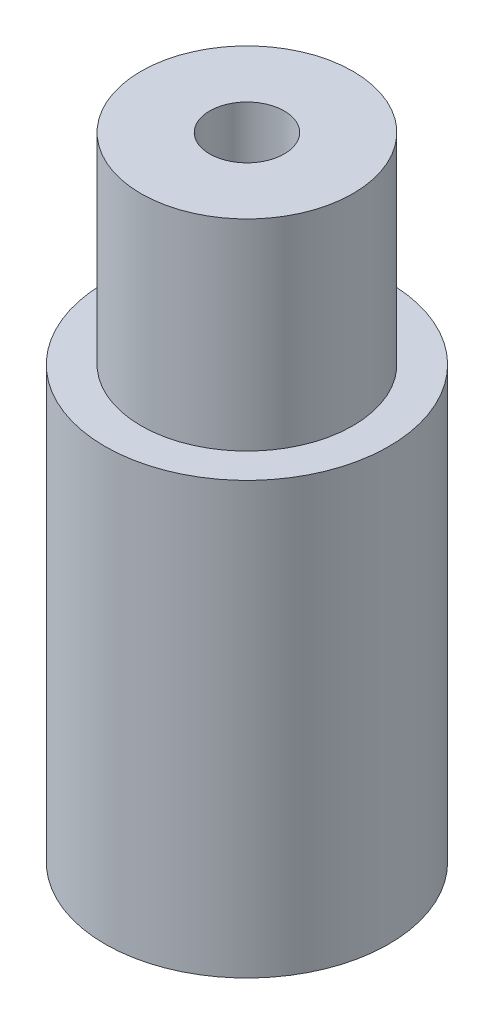
ISO-10303-21;
HEADER;
FILE_DESCRIPTION(('STEP AP214'),'2;1');
FILE_NAME('part.step','',(''),(''),'','','');
FILE_SCHEMA(('AUTOMOTIVE_DESIGN { 1 0 10303 214 1 1 1 1 }'));
ENDSEC;
DATA;
#1=APPLICATION_CONTEXT('core data for automotive mechanical design processes');
#2=APPLICATION_PROTOCOL_DEFINITION('international standard','automotive_design',2000,#1);
#3=PRODUCT_CONTEXT('',#1,'mechanical');
#4=PRODUCT('Part','Part','',(#3));
#5=PRODUCT_RELATED_PRODUCT_CATEGORY('part','',(#4));
#6=PRODUCT_DEFINITION_FORMATION('','',#4);
#7=PRODUCT_DEFINITION_CONTEXT('part definition',#1,'design');
#8=PRODUCT_DEFINITION('design','',#6,#7);
#9=PRODUCT_DEFINITION_SHAPE('','',#8);
#10=(LENGTH_UNIT() NAMED_UNIT(*) SI_UNIT(.MILLI.,.METRE.));
#11=(NAMED_UNIT(*) PLANE_ANGLE_UNIT() SI_UNIT($,.RADIAN.));
#12=(NAMED_UNIT(*) SI_UNIT($,.STERADIAN.) SOLID_ANGLE_UNIT());
#13=UNCERTAINTY_MEASURE_WITH_UNIT(LENGTH_MEASURE(1.E-05),#10,'distance_accuracy_value','');
#14=(GEOMETRIC_REPRESENTATION_CONTEXT(3) GLOBAL_UNCERTAINTY_ASSIGNED_CONTEXT((#13)) GLOBAL_UNIT_ASSIGNED_CONTEXT((#10,
#11,#12)) REPRESENTATION_CONTEXT('',''));
#15=CARTESIAN_POINT('',(0.,0.,0.));
#16=DIRECTION('',(0.,0.,1.));
#17=DIRECTION('',(1.,0.,0.));
#18=AXIS2_PLACEMENT_3D('',#15,#16,#17);
#19=CARTESIAN_POINT('',(0.,0.149999954,0.));
#20=DIRECTION('',(0.,1.,0.));
#21=DIRECTION('',(0.,0.,1.));
#22=AXIS2_PLACEMENT_3D('',#19,#20,#21);
#23=PLANE('',#22);
#24=DIRECTION('',(0.707106781186548,0.,0.707106781186547));
#25=VECTOR('',#24,1.);
#26=CARTESIAN_POINT('',(-5.05581345295691,0.149999954,5.05581345295691));
#27=LINE('',#26,#25);
#28=CARTESIAN_POINT('',(-8.88302890612909,0.149999954,1.22859799978472));
#29=VERTEX_POINT('',#28);
#30=CARTESIAN_POINT('',(-7.149999954,0.149999954,2.96162695191381));
#31=VERTEX_POINT('',#30);
#32=EDGE_CURVE('E153',#29,#31,#27,.T.);
#33=ORIENTED_EDGE('',*,*,#32,.T.);
#34=DIRECTION('',(0.,0.,1.));
#35=VECTOR('',#34,1.);
#36=CARTESIAN_POINT('',(-7.149999954,0.149999954,0.));
#37=LINE('',#36,#35);
#38=CARTESIAN_POINT('',(-7.149999954,0.149999954,5.4125));
#39=VERTEX_POINT('',#38);
#40=EDGE_CURVE('E140',#31,#39,#37,.T.);
#41=ORIENTED_EDGE('',*,*,#40,.T.);
#42=CARTESIAN_POINT('',(-5.4125,0.149999954,5.4125));
#43=DIRECTION('',(0.,1.,0.));
#44=DIRECTION('',(0.,0.,1.));
#45=AXIS2_PLACEMENT_3D('',#42,#43,#44);
#46=CIRCLE('',#45,1.737499954);
#47=CARTESIAN_POINT('',(-5.4125,0.149999954,7.149999954));
#48=VERTEX_POINT('',#47);
#49=EDGE_CURVE('E134',#48,#39,#46,.F.);
#50=ORIENTED_EDGE('',*,*,#49,.F.);
#51=DIRECTION('',(1.,0.,0.));
#52=VECTOR('',#51,1.);
#53=CARTESIAN_POINT('',(0.,0.149999954,7.149999954));
#54=LINE('',#53,#52);
#55=CARTESIAN_POINT('',(-2.96162695191381,0.149999954,7.149999954));
#56=VERTEX_POINT('',#55);
#57=EDGE_CURVE('E410',#48,#56,#54,.T.);
#58=ORIENTED_EDGE('',*,*,#57,.T.);
#59=DIRECTION('',(0.707106781186548,0.,0.707106781186547));
#60=VECTOR('',#59,1.);
#61=CARTESIAN_POINT('',(-5.05581345295691,0.149999954,5.05581345295691));
#62=LINE('',#61,#60);
#63=CARTESIAN_POINT('',(-1.22859799978472,0.149999954,8.88302890612909));
#64=VERTEX_POINT('',#63);
#65=EDGE_CURVE('E404',#56,#64,#62,.T.);
#66=ORIENTED_EDGE('',*,*,#65,.T.);
#67=CARTESIAN_POINT('',(0.,0.149999954,7.65443090634438));
#68=DIRECTION('',(0.,1.,0.));
#69=DIRECTION('',(0.,0.,1.));
#70=AXIS2_PLACEMENT_3D('',#67,#68,#69);
#71=CIRCLE('',#70,1.737499954);
#72=CARTESIAN_POINT('',(1.22859799978472,0.149999954,8.88302890612908));
#73=VERTEX_POINT('',#72);
#74=EDGE_CURVE('E399',#73,#64,#71,.F.);
#75=ORIENTED_EDGE('',*,*,#74,.F.);
#76=DIRECTION('',(0.707106781186548,0.,-0.707106781186548));
#77=VECTOR('',#76,1.);
#78=CARTESIAN_POINT('',(5.0558134529569,0.149999954,5.0558134529569));
#79=LINE('',#78,#77);
#80=CARTESIAN_POINT('',(2.96162695191381,0.149999954,7.149999954));
#81=VERTEX_POINT('',#80);
#82=EDGE_CURVE('E393',#73,#81,#79,.T.);
#83=ORIENTED_EDGE('',*,*,#82,.T.);
#84=DIRECTION('',(1.,0.,0.));
#85=VECTOR('',#84,1.);
#86=CARTESIAN_POINT('',(0.,0.149999954,7.149999954));
#87=LINE('',#86,#85);
#88=CARTESIAN_POINT('',(5.4125,0.149999954,7.149999954));
#89=VERTEX_POINT('',#88);
#90=EDGE_CURVE('E387',#81,#89,#87,.T.);
#91=ORIENTED_EDGE('',*,*,#90,.T.);
#92=CARTESIAN_POINT('',(5.4125,0.149999954,5.4125));
#93=DIRECTION('',(0.,1.,0.));
#94=DIRECTION('',(0.,0.,1.));
#95=AXIS2_PLACEMENT_3D('',#92,#93,#94);
#96=CIRCLE('',#95,1.737499954);
#97=CARTESIAN_POINT('',(7.149999954,0.149999954,5.4125));
#98=VERTEX_POINT('',#97);
#99=EDGE_CURVE('E382',#98,#89,#96,.F.);
#100=ORIENTED_EDGE('',*,*,#99,.F.);
#101=DIRECTION('',(0.,0.,1.));
#102=VECTOR('',#101,1.);
#103=CARTESIAN_POINT('',(7.149999954,0.149999954,0.));
#104=LINE('',#103,#102);
#105=CARTESIAN_POINT('',(7.149999954,0.149999954,2.96162695191381));
#106=VERTEX_POINT('',#105);
#107=EDGE_CURVE('E377',#106,#98,#104,.T.);
#108=ORIENTED_EDGE('',*,*,#107,.F.);
#109=DIRECTION('',(0.707106781186548,0.,-0.707106781186548));
#110=VECTOR('',#109,1.);
#111=CARTESIAN_POINT('',(5.0558134529569,0.149999954,5.0558134529569));
#112=LINE('',#111,#110);
#113=CARTESIAN_POINT('',(8.88302890612909,0.149999954,1.22859799978472));
#114=VERTEX_POINT('',#113);
#115=EDGE_CURVE('E371',#106,#114,#112,.T.);
#116=ORIENTED_EDGE('',*,*,#115,.T.);
#117=CARTESIAN_POINT('',(7.65443090634438,0.149999954,0.));
#118=DIRECTION('',(0.,1.,0.));
#119=DIRECTION('',(0.,0.,1.));
#120=AXIS2_PLACEMENT_3D('',#117,#118,#119);
#121=CIRCLE('',#120,1.737499954);
#122=CARTESIAN_POINT('',(8.88302890612909,0.149999954,-1.22859799978471));
#123=VERTEX_POINT('',#122);
#124=EDGE_CURVE('E366',#123,#114,#121,.F.);
#125=ORIENTED_EDGE('',*,*,#124,.F.);
#126=DIRECTION('',(0.707106781186548,0.,0.707106781186548));
#127=VECTOR('',#126,1.);
#128=CARTESIAN_POINT('',(5.0558134529569,0.149999954,-5.0558134529569));
#129=LINE('',#128,#127);
#130=CARTESIAN_POINT('',(7.149999954,0.149999954,-2.9616269519138));
#131=VERTEX_POINT('',#130);
#132=EDGE_CURVE('E361',#131,#123,#129,.T.);
#133=ORIENTED_EDGE('',*,*,#132,.F.);
#134=DIRECTION('',(0.,0.,1.));
#135=VECTOR('',#134,1.);
#136=CARTESIAN_POINT('',(7.149999954,0.149999954,0.));
#137=LINE('',#136,#135);
#138=CARTESIAN_POINT('',(7.149999954,0.149999954,-5.4125));
#139=VERTEX_POINT('',#138);
#140=EDGE_CURVE('E356',#139,#131,#137,.T.);
#141=ORIENTED_EDGE('',*,*,#140,.F.);
#142=CARTESIAN_POINT('',(5.4125,0.149999954,-5.4125));
#143=DIRECTION('',(0.,1.,0.));
#144=DIRECTION('',(0.,0.,1.));
#145=AXIS2_PLACEMENT_3D('',#142,#143,#144);
#146=CIRCLE('',#145,1.737499954);
#147=CARTESIAN_POINT('',(5.4125,0.149999954,-7.149999954));
#148=VERTEX_POINT('',#147);
#149=EDGE_CURVE('E351',#148,#139,#146,.F.);
#150=ORIENTED_EDGE('',*,*,#149,.F.);
#151=DIRECTION('',(1.,0.,0.));
#152=VECTOR('',#151,1.);
#153=CARTESIAN_POINT('',(0.,0.149999954,-7.149999954));
#154=LINE('',#153,#152);
#155=CARTESIAN_POINT('',(2.9616269519138,0.149999954,-7.149999954));
#156=VERTEX_POINT('',#155);
#157=EDGE_CURVE('E346',#156,#148,#154,.T.);
#158=ORIENTED_EDGE('',*,*,#157,.F.);
#159=DIRECTION('',(0.707106781186548,0.,0.707106781186548));
#160=VECTOR('',#159,1.);
#161=CARTESIAN_POINT('',(5.0558134529569,0.149999954,-5.0558134529569));
#162=LINE('',#161,#160);
#163=CARTESIAN_POINT('',(1.22859799978471,0.149999954,-8.88302890612909));
#164=VERTEX_POINT('',#163);
#165=EDGE_CURVE('E341',#164,#156,#162,.T.);
#166=ORIENTED_EDGE('',*,*,#165,.F.);
#167=CARTESIAN_POINT('',(0.,0.149999954,-7.65443090634438));
#168=DIRECTION('',(0.,1.,0.));
#169=DIRECTION('',(0.,0.,1.));
#170=AXIS2_PLACEMENT_3D('',#167,#168,#169);
#171=CIRCLE('',#170,1.737499954);
#172=CARTESIAN_POINT('',(-1.22859799978472,0.149999954,-8.88302890612909));
#173=VERTEX_POINT('',#172);
#174=EDGE_CURVE('E336',#173,#164,#171,.F.);
#175=ORIENTED_EDGE('',*,*,#174,.F.);
#176=DIRECTION('',(0.707106781186547,0.,-0.707106781186548));
#177=VECTOR('',#176,1.);
#178=CARTESIAN_POINT('',(-5.0558134529569,0.149999954,-5.0558134529569));
#179=LINE('',#178,#177);
#180=CARTESIAN_POINT('',(-2.96162695191381,0.149999954,-7.149999954));
#181=VERTEX_POINT('',#180);
#182=EDGE_CURVE('E331',#181,#173,#179,.T.);
#183=ORIENTED_EDGE('',*,*,#182,.F.);
#184=DIRECTION('',(1.,0.,0.));
#185=VECTOR('',#184,1.);
#186=CARTESIAN_POINT('',(0.,0.149999954,-7.149999954));
#187=LINE('',#186,#185);
#188=CARTESIAN_POINT('',(-5.4125,0.149999954,-7.149999954));
#189=VERTEX_POINT('',#188);
#190=EDGE_CURVE('E326',#189,#181,#187,.T.);
#191=ORIENTED_EDGE('',*,*,#190,.F.);
#192=CARTESIAN_POINT('',(-5.4125,0.149999954,-5.4125));
#193=DIRECTION('',(0.,1.,0.));
#194=DIRECTION('',(0.,0.,1.));
#195=AXIS2_PLACEMENT_3D('',#192,#193,#194);
#196=CIRCLE('',#195,1.737499954);
#197=CARTESIAN_POINT('',(-7.149999954,0.149999954,-5.4125));
#198=VERTEX_POINT('',#197);
#199=EDGE_CURVE('E321',#198,#189,#196,.F.);
#200=ORIENTED_EDGE('',*,*,#199,.F.);
#201=DIRECTION('',(0.,0.,1.));
#202=VECTOR('',#201,1.);
#203=CARTESIAN_POINT('',(-7.149999954,0.149999954,0.));
#204=LINE('',#203,#202);
#205=CARTESIAN_POINT('',(-7.149999954,0.149999954,-2.96162695191381));
#206=VERTEX_POINT('',#205);
#207=EDGE_CURVE('E315',#198,#206,#204,.T.);
#208=ORIENTED_EDGE('',*,*,#207,.T.);
#209=DIRECTION('',(0.707106781186547,0.,-0.707106781186548));
#210=VECTOR('',#209,1.);
#211=CARTESIAN_POINT('',(-5.0558134529569,0.149999954,-5.0558134529569));
#212=LINE('',#211,#210);
#213=CARTESIAN_POINT('',(-8.8830289061291,0.149999954,-1.22859799978471));
#214=VERTEX_POINT('',#213);
#215=EDGE_CURVE('E310',#214,#206,#212,.T.);
#216=ORIENTED_EDGE('',*,*,#215,.F.);
#217=CARTESIAN_POINT('',(-7.65443090634438,0.149999954,0.));
#218=DIRECTION('',(0.,1.,0.));
#219=DIRECTION('',(0.,0.,1.));
#220=AXIS2_PLACEMENT_3D('',#217,#218,#219);
#221=CIRCLE('',#220,1.737499954);
#222=EDGE_CURVE('E157',#29,#214,#221,.F.);
#223=ORIENTED_EDGE('',*,*,#222,.F.);
#224=EDGE_LOOP('',(#33,#41,#50,#58,#66,#75,#83,#91,#100,#108,#116,#125,#133,#141,#150,#158,#166,
#175,#183,#191,#200,#208,#216,#223));
#225=FACE_BOUND('',#224,.T.);
#226=CARTESIAN_POINT('',(0.,0.149999954000002,0.));
#227=DIRECTION('',(0.,1.,0.));
#228=DIRECTION('',(0.,0.,1.));
#229=AXIS2_PLACEMENT_3D('',#226,#227,#228);
#230=CIRCLE('',#229,12.550000046);
#231=CARTESIAN_POINT('',(0.,0.149999954000002,12.550000046));
#232=VERTEX_POINT('',#231);
#233=EDGE_CURVE('E40',#232,#232,#230,.T.);
#234=ORIENTED_EDGE('',*,*,#233,.F.);
#235=EDGE_LOOP('',(#234));
#236=FACE_BOUND('',#235,.T.);
#237=ADVANCED_FACE('F36',(#225,#236),#23,.F.);
#238=CARTESIAN_POINT('',(0.,38.4175,0.));
#239=DIRECTION('',(0.,-1.,0.));
#240=DIRECTION('',(0.,0.,-1.));
#241=AXIS2_PLACEMENT_3D('',#238,#239,#240);
#242=CYLINDRICAL_SURFACE('',#241,12.550000046);
#243=ORIENTED_EDGE('',*,*,#233,.T.);
#244=EDGE_LOOP('',(#243));
#245=FACE_BOUND('',#244,.T.);
#246=CARTESIAN_POINT('',(0.,38.267500046,0.));
#247=DIRECTION('',(0.,1.,0.));
#248=DIRECTION('',(0.,0.,1.));
#249=AXIS2_PLACEMENT_3D('',#246,#247,#248);
#250=CIRCLE('',#249,12.550000046);
#251=CARTESIAN_POINT('',(0.,38.267500046,12.550000046));
#252=VERTEX_POINT('',#251);
#253=EDGE_CURVE('E166',#252,#252,#250,.T.);
#254=ORIENTED_EDGE('',*,*,#253,.F.);
#255=EDGE_LOOP('',(#254));
#256=FACE_BOUND('',#255,.T.);
#257=ADVANCED_FACE('F173',(#245,#256),#242,.T.);
#258=CARTESIAN_POINT('',(0.,38.267500046,0.));
#259=DIRECTION('',(0.,1.,0.));
#260=DIRECTION('',(0.,0.,1.));
#261=AXIS2_PLACEMENT_3D('',#258,#259,#260);
#262=PLANE('',#261);
#263=ORIENTED_EDGE('',*,*,#253,.T.);
#264=EDGE_LOOP('',(#263));
#265=FACE_BOUND('',#264,.T.);
#266=CARTESIAN_POINT('',(0.,38.267500046,0.));
#267=DIRECTION('',(0.,1.,0.));
#268=DIRECTION('',(0.,0.,1.));
#269=AXIS2_PLACEMENT_3D('',#266,#267,#268);
#270=CIRCLE('',#269,9.375000046);
#271=CARTESIAN_POINT('',(0.,38.267500046,9.375000046));
#272=VERTEX_POINT('',#271);
#273=EDGE_CURVE('E162',#272,#272,#270,.T.);
#274=ORIENTED_EDGE('',*,*,#273,.F.);
#275=EDGE_LOOP('',(#274));
#276=FACE_BOUND('',#275,.T.);
#277=ADVANCED_FACE('F180',(#265,#276),#262,.T.);
#278=CARTESIAN_POINT('',(0.,56.1975,0.));
#279=DIRECTION('',(0.,-1.,0.));
#280=DIRECTION('',(0.,0.,-1.));
#281=AXIS2_PLACEMENT_3D('',#278,#279,#280);
#282=CYLINDRICAL_SURFACE('',#281,9.375000046);
#283=ORIENTED_EDGE('',*,*,#273,.T.);
#284=EDGE_LOOP('',(#283));
#285=FACE_BOUND('',#284,.T.);
#286=CARTESIAN_POINT('',(0.,56.047500046,0.));
#287=DIRECTION('',(0.,1.,0.));
#288=DIRECTION('',(0.,0.,1.));
#289=AXIS2_PLACEMENT_3D('',#286,#287,#288);
#290=CIRCLE('',#289,9.375000046);
#291=CARTESIAN_POINT('',(0.,56.047500046,9.375000046));
#292=VERTEX_POINT('',#291);
#293=EDGE_CURVE('E159',#292,#292,#290,.T.);
#294=ORIENTED_EDGE('',*,*,#293,.F.);
#295=EDGE_LOOP('',(#294));
#296=FACE_BOUND('',#295,.T.);
#297=ADVANCED_FACE('F214',(#285,#296),#282,.T.);
#298=CARTESIAN_POINT('',(0.,56.047500046,0.));
#299=DIRECTION('',(0.,1.,0.));
#300=DIRECTION('',(0.,0.,1.));
#301=AXIS2_PLACEMENT_3D('',#298,#299,#300);
#302=PLANE('',#301);
#303=ORIENTED_EDGE('',*,*,#293,.T.);
#304=EDGE_LOOP('',(#303));
#305=FACE_BOUND('',#304,.T.);
#306=CARTESIAN_POINT('',(0.,56.047500046,0.));
#307=DIRECTION('',(0.,1.,0.));
#308=DIRECTION('',(0.,0.,1.));
#309=AXIS2_PLACEMENT_3D('',#306,#307,#308);
#310=CIRCLE('',#309,3.299599954);
#311=CARTESIAN_POINT('',(0.,56.047500046,3.299599954));
#312=VERTEX_POINT('',#311);
#313=EDGE_CURVE('E46',#312,#312,#310,.T.);
#314=ORIENTED_EDGE('',*,*,#313,.F.);
#315=EDGE_LOOP('',(#314));
#316=FACE_BOUND('',#315,.T.);
#317=ADVANCED_FACE('F184',(#305,#316),#302,.T.);
#318=CARTESIAN_POINT('',(-5.05581345295691,11.176,5.05581345295691));
#319=DIRECTION('',(0.707106781186548,0.,-0.707106781186548));
#320=DIRECTION('',(-0.707106781186548,0.,-0.707106781186547));
#321=AXIS2_PLACEMENT_3D('',#318,#319,#320);
#322=PLANE('',#321);
#323=ORIENTED_EDGE('',*,*,#32,.F.);
#324=DIRECTION('',(0.,-1.,0.));
#325=VECTOR('',#324,1.);
#326=CARTESIAN_POINT('',(-8.88302890612909,11.176,1.22859799978472));
#327=LINE('',#326,#325);
#328=CARTESIAN_POINT('',(-8.88302890612909,11.325999954,1.22859799978472));
#329=VERTEX_POINT('',#328);
#330=EDGE_CURVE('E308',#329,#29,#327,.T.);
#331=ORIENTED_EDGE('',*,*,#330,.F.);
#332=DIRECTION('',(0.707106781186548,0.,0.707106781186547));
#333=VECTOR('',#332,1.);
#334=CARTESIAN_POINT('',(-5.05581345295691,11.325999954,5.05581345295691));
#335=LINE('',#334,#333);
#336=CARTESIAN_POINT('',(-7.149999954,11.325999954,2.96162695191381));
#337=VERTEX_POINT('',#336);
#338=EDGE_CURVE('E55',#329,#337,#335,.T.);
#339=ORIENTED_EDGE('',*,*,#338,.T.);
#340=DIRECTION('',(0.,-1.,0.));
#341=VECTOR('',#340,1.);
#342=CARTESIAN_POINT('',(-7.149999954,11.176,2.96162695191381));
#343=LINE('',#342,#341);
#344=EDGE_CURVE('E144',#337,#31,#343,.T.);
#345=ORIENTED_EDGE('',*,*,#344,.T.);
#346=EDGE_LOOP('',(#323,#331,#339,#345));
#347=FACE_BOUND('',#346,.T.);
#348=ADVANCED_FACE('F151',(#347),#322,.T.);
#349=CARTESIAN_POINT('',(-7.149999954,11.176,0.));
#350=DIRECTION('',(1.,0.,0.));
#351=DIRECTION('',(0.,0.,-1.));
#352=AXIS2_PLACEMENT_3D('',#349,#350,#351);
#353=PLANE('',#352);
#354=ORIENTED_EDGE('',*,*,#40,.F.);
#355=ORIENTED_EDGE('',*,*,#344,.F.);
#356=DIRECTION('',(0.,0.,1.));
#357=VECTOR('',#356,1.);
#358=CARTESIAN_POINT('',(-7.149999954,11.325999954,0.));
#359=LINE('',#358,#357);
#360=CARTESIAN_POINT('',(-7.149999954,11.325999954,5.4125));
#361=VERTEX_POINT('',#360);
#362=EDGE_CURVE('E302',#337,#361,#359,.T.);
#363=ORIENTED_EDGE('',*,*,#362,.T.);
#364=DIRECTION('',(0.,1.,0.));
#365=VECTOR('',#364,1.);
#366=CARTESIAN_POINT('',(-7.149999954,11.176,5.4125));
#367=LINE('',#366,#365);
#368=EDGE_CURVE('E145',#361,#39,#367,.F.);
#369=ORIENTED_EDGE('',*,*,#368,.T.);
#370=EDGE_LOOP('',(#354,#355,#363,#369));
#371=FACE_BOUND('',#370,.T.);
#372=ADVANCED_FACE('F142',(#371),#353,.T.);
#373=CARTESIAN_POINT('',(-5.4125,11.176,5.4125));
#374=DIRECTION('',(0.,-1.,0.));
#375=DIRECTION('',(0.,0.,-1.));
#376=AXIS2_PLACEMENT_3D('',#373,#374,#375);
#377=CYLINDRICAL_SURFACE('',#376,1.737499954);
#378=ORIENTED_EDGE('',*,*,#49,.T.);
#379=ORIENTED_EDGE('',*,*,#368,.F.);
#380=CARTESIAN_POINT('',(-5.4125,11.325999954,5.4125));
#381=DIRECTION('',(0.,-1.,0.));
#382=DIRECTION('',(0.,0.,-1.));
#383=AXIS2_PLACEMENT_3D('',#380,#381,#382);
#384=CIRCLE('',#383,1.737499954);
#385=CARTESIAN_POINT('',(-5.4125,11.325999954,7.149999954));
#386=VERTEX_POINT('',#385);
#387=EDGE_CURVE('E299',#386,#361,#384,.T.);
#388=ORIENTED_EDGE('',*,*,#387,.F.);
#389=DIRECTION('',(0.,-1.,0.));
#390=VECTOR('',#389,1.);
#391=CARTESIAN_POINT('',(-5.4125,11.176,7.149999954));
#392=LINE('',#391,#390);
#393=EDGE_CURVE('E413',#386,#48,#392,.T.);
#394=ORIENTED_EDGE('',*,*,#393,.T.);
#395=EDGE_LOOP('',(#378,#379,#388,#394));
#396=FACE_BOUND('',#395,.T.);
#397=ADVANCED_FACE('F418',(#396),#377,.F.);
#398=CARTESIAN_POINT('',(0.,11.176,7.149999954));
#399=DIRECTION('',(0.,0.,-1.));
#400=DIRECTION('',(-1.,0.,0.));
#401=AXIS2_PLACEMENT_3D('',#398,#399,#400);
#402=PLANE('',#401);
#403=ORIENTED_EDGE('',*,*,#57,.F.);
#404=ORIENTED_EDGE('',*,*,#393,.F.);
#405=DIRECTION('',(1.,0.,0.));
#406=VECTOR('',#405,1.);
#407=CARTESIAN_POINT('',(0.,11.325999954,7.149999954));
#408=LINE('',#407,#406);
#409=CARTESIAN_POINT('',(-2.96162695191381,11.325999954,7.149999954));
#410=VERTEX_POINT('',#409);
#411=EDGE_CURVE('E296',#386,#410,#408,.T.);
#412=ORIENTED_EDGE('',*,*,#411,.T.);
#413=DIRECTION('',(0.,-1.,0.));
#414=VECTOR('',#413,1.);
#415=CARTESIAN_POINT('',(-2.96162695191381,11.176,7.149999954));
#416=LINE('',#415,#414);
#417=EDGE_CURVE('E407',#410,#56,#416,.T.);
#418=ORIENTED_EDGE('',*,*,#417,.T.);
#419=EDGE_LOOP('',(#403,#404,#412,#418));
#420=FACE_BOUND('',#419,.T.);
#421=ADVANCED_FACE('F422',(#420),#402,.T.);
#422=CARTESIAN_POINT('',(-5.05581345295691,11.176,5.05581345295691));
#423=DIRECTION('',(0.707106781186548,0.,-0.707106781186548));
#424=DIRECTION('',(-0.707106781186548,0.,-0.707106781186547));
#425=AXIS2_PLACEMENT_3D('',#422,#423,#424);
#426=PLANE('',#425);
#427=ORIENTED_EDGE('',*,*,#65,.F.);
#428=ORIENTED_EDGE('',*,*,#417,.F.);
#429=DIRECTION('',(0.707106781186548,0.,0.707106781186547));
#430=VECTOR('',#429,1.);
#431=CARTESIAN_POINT('',(-5.05581345295691,11.325999954,5.05581345295691));
#432=LINE('',#431,#430);
#433=CARTESIAN_POINT('',(-1.22859799978472,11.325999954,8.88302890612909));
#434=VERTEX_POINT('',#433);
#435=EDGE_CURVE('E293',#410,#434,#432,.T.);
#436=ORIENTED_EDGE('',*,*,#435,.T.);
#437=DIRECTION('',(0.,1.,0.));
#438=VECTOR('',#437,1.);
#439=CARTESIAN_POINT('',(-1.22859799978472,11.176,8.88302890612909));
#440=LINE('',#439,#438);
#441=EDGE_CURVE('E401',#434,#64,#440,.F.);
#442=ORIENTED_EDGE('',*,*,#441,.T.);
#443=EDGE_LOOP('',(#427,#428,#436,#442));
#444=FACE_BOUND('',#443,.T.);
#445=ADVANCED_FACE('F427',(#444),#426,.T.);
#446=CARTESIAN_POINT('',(0.,11.176,7.65443090634438));
#447=DIRECTION('',(0.,-1.,0.));
#448=DIRECTION('',(0.,0.,-1.));
#449=AXIS2_PLACEMENT_3D('',#446,#447,#448);
#450=CYLINDRICAL_SURFACE('',#449,1.737499954);
#451=ORIENTED_EDGE('',*,*,#74,.T.);
#452=ORIENTED_EDGE('',*,*,#441,.F.);
#453=CARTESIAN_POINT('',(0.,11.325999954,7.65443090634438));
#454=DIRECTION('',(0.,-1.,0.));
#455=DIRECTION('',(0.,0.,-1.));
#456=AXIS2_PLACEMENT_3D('',#453,#454,#455);
#457=CIRCLE('',#456,1.737499954);
#458=CARTESIAN_POINT('',(1.22859799978472,11.325999954,8.88302890612908));
#459=VERTEX_POINT('',#458);
#460=EDGE_CURVE('E290',#459,#434,#457,.T.);
#461=ORIENTED_EDGE('',*,*,#460,.F.);
#462=DIRECTION('',(0.,-1.,0.));
#463=VECTOR('',#462,1.);
#464=CARTESIAN_POINT('',(1.22859799978472,11.176,8.88302890612908));
#465=LINE('',#464,#463);
#466=EDGE_CURVE('E396',#459,#73,#465,.T.);
#467=ORIENTED_EDGE('',*,*,#466,.T.);
#468=EDGE_LOOP('',(#451,#452,#461,#467));
#469=FACE_BOUND('',#468,.T.);
#470=ADVANCED_FACE('F550',(#469),#450,.F.);
#471=CARTESIAN_POINT('',(5.0558134529569,11.176,5.0558134529569));
#472=DIRECTION('',(-0.707106781186548,0.,-0.707106781186548));
#473=DIRECTION('',(-0.707106781186548,0.,0.707106781186548));
#474=AXIS2_PLACEMENT_3D('',#471,#472,#473);
#475=PLANE('',#474);
#476=ORIENTED_EDGE('',*,*,#82,.F.);
#477=ORIENTED_EDGE('',*,*,#466,.F.);
#478=DIRECTION('',(0.707106781186548,0.,-0.707106781186548));
#479=VECTOR('',#478,1.);
#480=CARTESIAN_POINT('',(5.0558134529569,11.325999954,5.0558134529569));
#481=LINE('',#480,#479);
#482=CARTESIAN_POINT('',(2.96162695191381,11.325999954,7.149999954));
#483=VERTEX_POINT('',#482);
#484=EDGE_CURVE('E287',#459,#483,#481,.T.);
#485=ORIENTED_EDGE('',*,*,#484,.T.);
#486=DIRECTION('',(0.,-1.,0.));
#487=VECTOR('',#486,1.);
#488=CARTESIAN_POINT('',(2.96162695191381,11.176,7.149999954));
#489=LINE('',#488,#487);
#490=EDGE_CURVE('E390',#483,#81,#489,.T.);
#491=ORIENTED_EDGE('',*,*,#490,.T.);
#492=EDGE_LOOP('',(#476,#477,#485,#491));
#493=FACE_BOUND('',#492,.T.);
#494=ADVANCED_FACE('F547',(#493),#475,.T.);
#495=CARTESIAN_POINT('',(0.,11.176,7.149999954));
#496=DIRECTION('',(0.,0.,-1.));
#497=DIRECTION('',(-1.,0.,0.));
#498=AXIS2_PLACEMENT_3D('',#495,#496,#497);
#499=PLANE('',#498);
#500=ORIENTED_EDGE('',*,*,#90,.F.);
#501=ORIENTED_EDGE('',*,*,#490,.F.);
#502=DIRECTION('',(1.,0.,0.));
#503=VECTOR('',#502,1.);
#504=CARTESIAN_POINT('',(0.,11.325999954,7.149999954));
#505=LINE('',#504,#503);
#506=CARTESIAN_POINT('',(5.4125,11.325999954,7.149999954));
#507=VERTEX_POINT('',#506);
#508=EDGE_CURVE('E284',#483,#507,#505,.T.);
#509=ORIENTED_EDGE('',*,*,#508,.T.);
#510=DIRECTION('',(0.,1.,0.));
#511=VECTOR('',#510,1.);
#512=CARTESIAN_POINT('',(5.4125,11.176,7.149999954));
#513=LINE('',#512,#511);
#514=EDGE_CURVE('E384',#507,#89,#513,.F.);
#515=ORIENTED_EDGE('',*,*,#514,.T.);
#516=EDGE_LOOP('',(#500,#501,#509,#515));
#517=FACE_BOUND('',#516,.T.);
#518=ADVANCED_FACE('F545',(#517),#499,.T.);
#519=CARTESIAN_POINT('',(5.4125,11.176,5.4125));
#520=DIRECTION('',(0.,-1.,0.));
#521=DIRECTION('',(0.,0.,-1.));
#522=AXIS2_PLACEMENT_3D('',#519,#520,#521);
#523=CYLINDRICAL_SURFACE('',#522,1.737499954);
#524=ORIENTED_EDGE('',*,*,#99,.T.);
#525=ORIENTED_EDGE('',*,*,#514,.F.);
#526=CARTESIAN_POINT('',(5.4125,11.325999954,5.4125));
#527=DIRECTION('',(0.,-1.,0.));
#528=DIRECTION('',(0.,0.,-1.));
#529=AXIS2_PLACEMENT_3D('',#526,#527,#528);
#530=CIRCLE('',#529,1.737499954);
#531=CARTESIAN_POINT('',(7.149999954,11.325999954,5.4125));
#532=VERTEX_POINT('',#531);
#533=EDGE_CURVE('E281',#532,#507,#530,.T.);
#534=ORIENTED_EDGE('',*,*,#533,.F.);
#535=DIRECTION('',(0.,-1.,0.));
#536=VECTOR('',#535,1.);
#537=CARTESIAN_POINT('',(7.149999954,11.176,5.4125));
#538=LINE('',#537,#536);
#539=EDGE_CURVE('E379',#532,#98,#538,.T.);
#540=ORIENTED_EDGE('',*,*,#539,.T.);
#541=EDGE_LOOP('',(#524,#525,#534,#540));
#542=FACE_BOUND('',#541,.T.);
#543=ADVANCED_FACE('F541',(#542),#523,.F.);
#544=CARTESIAN_POINT('',(7.149999954,11.176,0.));
#545=DIRECTION('',(1.,0.,0.));
#546=DIRECTION('',(0.,0.,-1.));
#547=AXIS2_PLACEMENT_3D('',#544,#545,#546);
#548=PLANE('',#547);
#549=ORIENTED_EDGE('',*,*,#107,.T.);
#550=ORIENTED_EDGE('',*,*,#539,.F.);
#551=DIRECTION('',(0.,0.,1.));
#552=VECTOR('',#551,1.);
#553=CARTESIAN_POINT('',(7.149999954,11.325999954,0.));
#554=LINE('',#553,#552);
#555=CARTESIAN_POINT('',(7.149999954,11.325999954,2.96162695191381));
#556=VERTEX_POINT('',#555);
#557=EDGE_CURVE('E278',#556,#532,#554,.T.);
#558=ORIENTED_EDGE('',*,*,#557,.F.);
#559=DIRECTION('',(0.,-1.,0.));
#560=VECTOR('',#559,1.);
#561=CARTESIAN_POINT('',(7.149999954,11.176,2.96162695191381));
#562=LINE('',#561,#560);
#563=EDGE_CURVE('E374',#556,#106,#562,.T.);
#564=ORIENTED_EDGE('',*,*,#563,.T.);
#565=EDGE_LOOP('',(#549,#550,#558,#564));
#566=FACE_BOUND('',#565,.T.);
#567=ADVANCED_FACE('F537',(#566),#548,.F.);
#568=CARTESIAN_POINT('',(5.0558134529569,11.176,5.0558134529569));
#569=DIRECTION('',(-0.707106781186548,0.,-0.707106781186548));
#570=DIRECTION('',(-0.707106781186548,0.,0.707106781186548));
#571=AXIS2_PLACEMENT_3D('',#568,#569,#570);
#572=PLANE('',#571);
#573=ORIENTED_EDGE('',*,*,#115,.F.);
#574=ORIENTED_EDGE('',*,*,#563,.F.);
#575=DIRECTION('',(0.707106781186548,0.,-0.707106781186548));
#576=VECTOR('',#575,1.);
#577=CARTESIAN_POINT('',(5.0558134529569,11.325999954,5.0558134529569));
#578=LINE('',#577,#576);
#579=CARTESIAN_POINT('',(8.88302890612909,11.325999954,1.22859799978472));
#580=VERTEX_POINT('',#579);
#581=EDGE_CURVE('E275',#556,#580,#578,.T.);
#582=ORIENTED_EDGE('',*,*,#581,.T.);
#583=DIRECTION('',(0.,1.,0.));
#584=VECTOR('',#583,1.);
#585=CARTESIAN_POINT('',(8.88302890612909,11.176,1.22859799978472));
#586=LINE('',#585,#584);
#587=EDGE_CURVE('E368',#580,#114,#586,.F.);
#588=ORIENTED_EDGE('',*,*,#587,.T.);
#589=EDGE_LOOP('',(#573,#574,#582,#588));
#590=FACE_BOUND('',#589,.T.);
#591=ADVANCED_FACE('F531',(#590),#572,.T.);
#592=CARTESIAN_POINT('',(7.65443090634438,11.176,0.));
#593=DIRECTION('',(0.,-1.,0.));
#594=DIRECTION('',(0.,0.,-1.));
#595=AXIS2_PLACEMENT_3D('',#592,#593,#594);
#596=CYLINDRICAL_SURFACE('',#595,1.737499954);
#597=ORIENTED_EDGE('',*,*,#124,.T.);
#598=ORIENTED_EDGE('',*,*,#587,.F.);
#599=CARTESIAN_POINT('',(7.65443090634438,11.325999954,0.));
#600=DIRECTION('',(0.,-1.,0.));
#601=DIRECTION('',(0.,0.,-1.));
#602=AXIS2_PLACEMENT_3D('',#599,#600,#601);
#603=CIRCLE('',#602,1.737499954);
#604=CARTESIAN_POINT('',(8.88302890612909,11.325999954,-1.22859799978471));
#605=VERTEX_POINT('',#604);
#606=EDGE_CURVE('E272',#605,#580,#603,.T.);
#607=ORIENTED_EDGE('',*,*,#606,.F.);
#608=DIRECTION('',(0.,-1.,0.));
#609=VECTOR('',#608,1.);
#610=CARTESIAN_POINT('',(8.88302890612909,11.176,-1.22859799978471));
#611=LINE('',#610,#609);
#612=EDGE_CURVE('E363',#605,#123,#611,.T.);
#613=ORIENTED_EDGE('',*,*,#612,.T.);
#614=EDGE_LOOP('',(#597,#598,#607,#613));
#615=FACE_BOUND('',#614,.T.);
#616=ADVANCED_FACE('F529',(#615),#596,.F.);
#617=CARTESIAN_POINT('',(5.0558134529569,11.176,-5.0558134529569));
#618=DIRECTION('',(0.707106781186548,0.,-0.707106781186548));
#619=DIRECTION('',(-0.707106781186548,0.,-0.707106781186548));
#620=AXIS2_PLACEMENT_3D('',#617,#618,#619);
#621=PLANE('',#620);
#622=ORIENTED_EDGE('',*,*,#132,.T.);
#623=ORIENTED_EDGE('',*,*,#612,.F.);
#624=DIRECTION('',(0.707106781186548,0.,0.707106781186548));
#625=VECTOR('',#624,1.);
#626=CARTESIAN_POINT('',(5.0558134529569,11.325999954,-5.0558134529569));
#627=LINE('',#626,#625);
#628=CARTESIAN_POINT('',(7.149999954,11.325999954,-2.9616269519138));
#629=VERTEX_POINT('',#628);
#630=EDGE_CURVE('E269',#629,#605,#627,.T.);
#631=ORIENTED_EDGE('',*,*,#630,.F.);
#632=DIRECTION('',(0.,-1.,0.));
#633=VECTOR('',#632,1.);
#634=CARTESIAN_POINT('',(7.149999954,11.176,-2.9616269519138));
#635=LINE('',#634,#633);
#636=EDGE_CURVE('E358',#629,#131,#635,.T.);
#637=ORIENTED_EDGE('',*,*,#636,.T.);
#638=EDGE_LOOP('',(#622,#623,#631,#637));
#639=FACE_BOUND('',#638,.T.);
#640=ADVANCED_FACE('F524',(#639),#621,.F.);
#641=CARTESIAN_POINT('',(7.149999954,11.176,0.));
#642=DIRECTION('',(1.,0.,0.));
#643=DIRECTION('',(0.,0.,-1.));
#644=AXIS2_PLACEMENT_3D('',#641,#642,#643);
#645=PLANE('',#644);
#646=ORIENTED_EDGE('',*,*,#140,.T.);
#647=ORIENTED_EDGE('',*,*,#636,.F.);
#648=DIRECTION('',(0.,0.,1.));
#649=VECTOR('',#648,1.);
#650=CARTESIAN_POINT('',(7.149999954,11.325999954,0.));
#651=LINE('',#650,#649);
#652=CARTESIAN_POINT('',(7.149999954,11.325999954,-5.4125));
#653=VERTEX_POINT('',#652);
#654=EDGE_CURVE('E266',#653,#629,#651,.T.);
#655=ORIENTED_EDGE('',*,*,#654,.F.);
#656=DIRECTION('',(0.,1.,0.));
#657=VECTOR('',#656,1.);
#658=CARTESIAN_POINT('',(7.149999954,11.176,-5.4125));
#659=LINE('',#658,#657);
#660=EDGE_CURVE('E353',#653,#139,#659,.F.);
#661=ORIENTED_EDGE('',*,*,#660,.T.);
#662=EDGE_LOOP('',(#646,#647,#655,#661));
#663=FACE_BOUND('',#662,.T.);
#664=ADVANCED_FACE('F520',(#663),#645,.F.);
#665=CARTESIAN_POINT('',(5.4125,11.176,-5.4125));
#666=DIRECTION('',(0.,-1.,0.));
#667=DIRECTION('',(0.,0.,-1.));
#668=AXIS2_PLACEMENT_3D('',#665,#666,#667);
#669=CYLINDRICAL_SURFACE('',#668,1.737499954);
#670=ORIENTED_EDGE('',*,*,#149,.T.);
#671=ORIENTED_EDGE('',*,*,#660,.F.);
#672=CARTESIAN_POINT('',(5.4125,11.325999954,-5.4125));
#673=DIRECTION('',(0.,-1.,0.));
#674=DIRECTION('',(0.,0.,-1.));
#675=AXIS2_PLACEMENT_3D('',#672,#673,#674);
#676=CIRCLE('',#675,1.737499954);
#677=CARTESIAN_POINT('',(5.4125,11.325999954,-7.149999954));
#678=VERTEX_POINT('',#677);
#679=EDGE_CURVE('E263',#678,#653,#676,.T.);
#680=ORIENTED_EDGE('',*,*,#679,.F.);
#681=DIRECTION('',(0.,-1.,0.));
#682=VECTOR('',#681,1.);
#683=CARTESIAN_POINT('',(5.4125,11.176,-7.149999954));
#684=LINE('',#683,#682);
#685=EDGE_CURVE('E348',#678,#148,#684,.T.);
#686=ORIENTED_EDGE('',*,*,#685,.T.);
#687=EDGE_LOOP('',(#670,#671,#680,#686));
#688=FACE_BOUND('',#687,.T.);
#689=ADVANCED_FACE('F513',(#688),#669,.F.);
#690=CARTESIAN_POINT('',(0.,11.176,-7.149999954));
#691=DIRECTION('',(0.,0.,-1.));
#692=DIRECTION('',(-1.,0.,0.));
#693=AXIS2_PLACEMENT_3D('',#690,#691,#692);
#694=PLANE('',#693);
#695=ORIENTED_EDGE('',*,*,#157,.T.);
#696=ORIENTED_EDGE('',*,*,#685,.F.);
#697=DIRECTION('',(1.,0.,0.));
#698=VECTOR('',#697,1.);
#699=CARTESIAN_POINT('',(0.,11.325999954,-7.149999954));
#700=LINE('',#699,#698);
#701=CARTESIAN_POINT('',(2.9616269519138,11.325999954,-7.149999954));
#702=VERTEX_POINT('',#701);
#703=EDGE_CURVE('E260',#702,#678,#700,.T.);
#704=ORIENTED_EDGE('',*,*,#703,.F.);
#705=DIRECTION('',(0.,-1.,0.));
#706=VECTOR('',#705,1.);
#707=CARTESIAN_POINT('',(2.9616269519138,11.176,-7.149999954));
#708=LINE('',#707,#706);
#709=EDGE_CURVE('E343',#702,#156,#708,.T.);
#710=ORIENTED_EDGE('',*,*,#709,.T.);
#711=EDGE_LOOP('',(#695,#696,#704,#710));
#712=FACE_BOUND('',#711,.T.);
#713=ADVANCED_FACE('F510',(#712),#694,.F.);
#714=CARTESIAN_POINT('',(5.0558134529569,11.176,-5.0558134529569));
#715=DIRECTION('',(0.707106781186548,0.,-0.707106781186548));
#716=DIRECTION('',(-0.707106781186548,0.,-0.707106781186548));
#717=AXIS2_PLACEMENT_3D('',#714,#715,#716);
#718=PLANE('',#717);
#719=ORIENTED_EDGE('',*,*,#165,.T.);
#720=ORIENTED_EDGE('',*,*,#709,.F.);
#721=DIRECTION('',(0.707106781186548,0.,0.707106781186548));
#722=VECTOR('',#721,1.);
#723=CARTESIAN_POINT('',(5.0558134529569,11.325999954,-5.0558134529569));
#724=LINE('',#723,#722);
#725=CARTESIAN_POINT('',(1.22859799978471,11.325999954,-8.88302890612909));
#726=VERTEX_POINT('',#725);
#727=EDGE_CURVE('E257',#726,#702,#724,.T.);
#728=ORIENTED_EDGE('',*,*,#727,.F.);
#729=DIRECTION('',(0.,1.,0.));
#730=VECTOR('',#729,1.);
#731=CARTESIAN_POINT('',(1.22859799978471,11.176,-8.88302890612909));
#732=LINE('',#731,#730);
#733=EDGE_CURVE('E338',#726,#164,#732,.F.);
#734=ORIENTED_EDGE('',*,*,#733,.T.);
#735=EDGE_LOOP('',(#719,#720,#728,#734));
#736=FACE_BOUND('',#735,.T.);
#737=ADVANCED_FACE('F504',(#736),#718,.F.);
#738=CARTESIAN_POINT('',(0.,11.176,-7.65443090634438));
#739=DIRECTION('',(0.,-1.,0.));
#740=DIRECTION('',(0.,0.,-1.));
#741=AXIS2_PLACEMENT_3D('',#738,#739,#740);
#742=CYLINDRICAL_SURFACE('',#741,1.737499954);
#743=ORIENTED_EDGE('',*,*,#174,.T.);
#744=ORIENTED_EDGE('',*,*,#733,.F.);
#745=CARTESIAN_POINT('',(0.,11.325999954,-7.65443090634438));
#746=DIRECTION('',(0.,-1.,0.));
#747=DIRECTION('',(0.,0.,-1.));
#748=AXIS2_PLACEMENT_3D('',#745,#746,#747);
#749=CIRCLE('',#748,1.737499954);
#750=CARTESIAN_POINT('',(-1.22859799978472,11.325999954,-8.88302890612909));
#751=VERTEX_POINT('',#750);
#752=EDGE_CURVE('E254',#751,#726,#749,.T.);
#753=ORIENTED_EDGE('',*,*,#752,.F.);
#754=DIRECTION('',(0.,-1.,0.));
#755=VECTOR('',#754,1.);
#756=CARTESIAN_POINT('',(-1.22859799978472,11.176,-8.88302890612909));
#757=LINE('',#756,#755);
#758=EDGE_CURVE('E333',#751,#173,#757,.T.);
#759=ORIENTED_EDGE('',*,*,#758,.T.);
#760=EDGE_LOOP('',(#743,#744,#753,#759));
#761=FACE_BOUND('',#760,.T.);
#762=ADVANCED_FACE('F500',(#761),#742,.F.);
#763=CARTESIAN_POINT('',(-5.0558134529569,11.176,-5.0558134529569));
#764=DIRECTION('',(-0.707106781186548,0.,-0.707106781186548));
#765=DIRECTION('',(-0.707106781186547,0.,0.707106781186548));
#766=AXIS2_PLACEMENT_3D('',#763,#764,#765);
#767=PLANE('',#766);
#768=ORIENTED_EDGE('',*,*,#182,.T.);
#769=ORIENTED_EDGE('',*,*,#758,.F.);
#770=DIRECTION('',(0.707106781186547,0.,-0.707106781186548));
#771=VECTOR('',#770,1.);
#772=CARTESIAN_POINT('',(-5.05581345295691,11.325999954,-5.0558134529569));
#773=LINE('',#772,#771);
#774=CARTESIAN_POINT('',(-2.96162695191381,11.325999954,-7.149999954));
#775=VERTEX_POINT('',#774);
#776=EDGE_CURVE('E251',#775,#751,#773,.T.);
#777=ORIENTED_EDGE('',*,*,#776,.F.);
#778=DIRECTION('',(0.,-1.,0.));
#779=VECTOR('',#778,1.);
#780=CARTESIAN_POINT('',(-2.96162695191381,11.176,-7.149999954));
#781=LINE('',#780,#779);
#782=EDGE_CURVE('E328',#775,#181,#781,.T.);
#783=ORIENTED_EDGE('',*,*,#782,.T.);
#784=EDGE_LOOP('',(#768,#769,#777,#783));
#785=FACE_BOUND('',#784,.T.);
#786=ADVANCED_FACE('F493',(#785),#767,.F.);
#787=CARTESIAN_POINT('',(0.,11.176,-7.149999954));
#788=DIRECTION('',(0.,0.,-1.));
#789=DIRECTION('',(-1.,0.,0.));
#790=AXIS2_PLACEMENT_3D('',#787,#788,#789);
#791=PLANE('',#790);
#792=ORIENTED_EDGE('',*,*,#190,.T.);
#793=ORIENTED_EDGE('',*,*,#782,.F.);
#794=DIRECTION('',(1.,0.,0.));
#795=VECTOR('',#794,1.);
#796=CARTESIAN_POINT('',(0.,11.325999954,-7.149999954));
#797=LINE('',#796,#795);
#798=CARTESIAN_POINT('',(-5.4125,11.325999954,-7.149999954));
#799=VERTEX_POINT('',#798);
#800=EDGE_CURVE('E248',#799,#775,#797,.T.);
#801=ORIENTED_EDGE('',*,*,#800,.F.);
#802=DIRECTION('',(0.,1.,0.));
#803=VECTOR('',#802,1.);
#804=CARTESIAN_POINT('',(-5.4125,11.176,-7.149999954));
#805=LINE('',#804,#803);
#806=EDGE_CURVE('E323',#799,#189,#805,.F.);
#807=ORIENTED_EDGE('',*,*,#806,.T.);
#808=EDGE_LOOP('',(#792,#793,#801,#807));
#809=FACE_BOUND('',#808,.T.);
#810=ADVANCED_FACE('F490',(#809),#791,.F.);
#811=CARTESIAN_POINT('',(-5.4125,11.176,-5.4125));
#812=DIRECTION('',(0.,-1.,0.));
#813=DIRECTION('',(0.,0.,-1.));
#814=AXIS2_PLACEMENT_3D('',#811,#812,#813);
#815=CYLINDRICAL_SURFACE('',#814,1.737499954);
#816=ORIENTED_EDGE('',*,*,#199,.T.);
#817=ORIENTED_EDGE('',*,*,#806,.F.);
#818=CARTESIAN_POINT('',(-5.4125,11.325999954,-5.4125));
#819=DIRECTION('',(0.,-1.,0.));
#820=DIRECTION('',(0.,0.,-1.));
#821=AXIS2_PLACEMENT_3D('',#818,#819,#820);
#822=CIRCLE('',#821,1.737499954);
#823=CARTESIAN_POINT('',(-7.149999954,11.325999954,-5.4125));
#824=VERTEX_POINT('',#823);
#825=EDGE_CURVE('E245',#824,#799,#822,.T.);
#826=ORIENTED_EDGE('',*,*,#825,.F.);
#827=DIRECTION('',(0.,-1.,0.));
#828=VECTOR('',#827,1.);
#829=CARTESIAN_POINT('',(-7.149999954,11.176,-5.4125));
#830=LINE('',#829,#828);
#831=EDGE_CURVE('E318',#824,#198,#830,.T.);
#832=ORIENTED_EDGE('',*,*,#831,.T.);
#833=EDGE_LOOP('',(#816,#817,#826,#832));
#834=FACE_BOUND('',#833,.T.);
#835=ADVANCED_FACE('F484',(#834),#815,.F.);
#836=CARTESIAN_POINT('',(-7.149999954,11.176,0.));
#837=DIRECTION('',(1.,0.,0.));
#838=DIRECTION('',(0.,0.,-1.));
#839=AXIS2_PLACEMENT_3D('',#836,#837,#838);
#840=PLANE('',#839);
#841=ORIENTED_EDGE('',*,*,#207,.F.);
#842=ORIENTED_EDGE('',*,*,#831,.F.);
#843=DIRECTION('',(0.,0.,1.));
#844=VECTOR('',#843,1.);
#845=CARTESIAN_POINT('',(-7.149999954,11.325999954,0.));
#846=LINE('',#845,#844);
#847=CARTESIAN_POINT('',(-7.149999954,11.325999954,-2.96162695191381));
#848=VERTEX_POINT('',#847);
#849=EDGE_CURVE('E242',#824,#848,#846,.T.);
#850=ORIENTED_EDGE('',*,*,#849,.T.);
#851=DIRECTION('',(0.,-1.,0.));
#852=VECTOR('',#851,1.);
#853=CARTESIAN_POINT('',(-7.149999954,11.176,-2.96162695191381));
#854=LINE('',#853,#852);
#855=EDGE_CURVE('E312',#848,#206,#854,.T.);
#856=ORIENTED_EDGE('',*,*,#855,.T.);
#857=EDGE_LOOP('',(#841,#842,#850,#856));
#858=FACE_BOUND('',#857,.T.);
#859=ADVANCED_FACE('F480',(#858),#840,.T.);
#860=CARTESIAN_POINT('',(-5.0558134529569,11.176,-5.0558134529569));
#861=DIRECTION('',(-0.707106781186548,0.,-0.707106781186548));
#862=DIRECTION('',(-0.707106781186547,0.,0.707106781186548));
#863=AXIS2_PLACEMENT_3D('',#860,#861,#862);
#864=PLANE('',#863);
#865=ORIENTED_EDGE('',*,*,#215,.T.);
#866=ORIENTED_EDGE('',*,*,#855,.F.);
#867=DIRECTION('',(0.707106781186547,0.,-0.707106781186548));
#868=VECTOR('',#867,1.);
#869=CARTESIAN_POINT('',(-5.05581345295691,11.325999954,-5.0558134529569));
#870=LINE('',#869,#868);
#871=CARTESIAN_POINT('',(-8.8830289061291,11.325999954,-1.22859799978471));
#872=VERTEX_POINT('',#871);
#873=EDGE_CURVE('E239',#872,#848,#870,.T.);
#874=ORIENTED_EDGE('',*,*,#873,.F.);
#875=DIRECTION('',(0.,1.,0.));
#876=VECTOR('',#875,1.);
#877=CARTESIAN_POINT('',(-8.8830289061291,11.176,-1.22859799978471));
#878=LINE('',#877,#876);
#879=EDGE_CURVE('E305',#872,#214,#878,.F.);
#880=ORIENTED_EDGE('',*,*,#879,.T.);
#881=EDGE_LOOP('',(#865,#866,#874,#880));
#882=FACE_BOUND('',#881,.T.);
#883=ADVANCED_FACE('F210',(#882),#864,.F.);
#884=CARTESIAN_POINT('',(-7.65443090634438,11.176,0.));
#885=DIRECTION('',(0.,-1.,0.));
#886=DIRECTION('',(0.,0.,-1.));
#887=AXIS2_PLACEMENT_3D('',#884,#885,#886);
#888=CYLINDRICAL_SURFACE('',#887,1.737499954);
#889=ORIENTED_EDGE('',*,*,#222,.T.);
#890=ORIENTED_EDGE('',*,*,#879,.F.);
#891=CARTESIAN_POINT('',(-7.65443090634438,11.325999954,0.));
#892=DIRECTION('',(0.,-1.,0.));
#893=DIRECTION('',(0.,0.,-1.));
#894=AXIS2_PLACEMENT_3D('',#891,#892,#893);
#895=CIRCLE('',#894,1.737499954);
#896=EDGE_CURVE('E237',#329,#872,#895,.T.);
#897=ORIENTED_EDGE('',*,*,#896,.F.);
#898=ORIENTED_EDGE('',*,*,#330,.T.);
#899=EDGE_LOOP('',(#889,#890,#897,#898));
#900=FACE_BOUND('',#899,.T.);
#901=ADVANCED_FACE('F207',(#900),#888,.F.);
#902=CARTESIAN_POINT('',(0.,11.325999954,0.));
#903=DIRECTION('',(0.,-1.,0.));
#904=DIRECTION('',(0.,0.,-1.));
#905=AXIS2_PLACEMENT_3D('',#902,#903,#904);
#906=PLANE('',#905);
#907=ORIENTED_EDGE('',*,*,#338,.F.);
#908=ORIENTED_EDGE('',*,*,#896,.T.);
#909=ORIENTED_EDGE('',*,*,#873,.T.);
#910=ORIENTED_EDGE('',*,*,#849,.F.);
#911=ORIENTED_EDGE('',*,*,#825,.T.);
#912=ORIENTED_EDGE('',*,*,#800,.T.);
#913=ORIENTED_EDGE('',*,*,#776,.T.);
#914=ORIENTED_EDGE('',*,*,#752,.T.);
#915=ORIENTED_EDGE('',*,*,#727,.T.);
#916=ORIENTED_EDGE('',*,*,#703,.T.);
#917=ORIENTED_EDGE('',*,*,#679,.T.);
#918=ORIENTED_EDGE('',*,*,#654,.T.);
#919=ORIENTED_EDGE('',*,*,#630,.T.);
#920=ORIENTED_EDGE('',*,*,#606,.T.);
#921=ORIENTED_EDGE('',*,*,#581,.F.);
#922=ORIENTED_EDGE('',*,*,#557,.T.);
#923=ORIENTED_EDGE('',*,*,#533,.T.);
#924=ORIENTED_EDGE('',*,*,#508,.F.);
#925=ORIENTED_EDGE('',*,*,#484,.F.);
#926=ORIENTED_EDGE('',*,*,#460,.T.);
#927=ORIENTED_EDGE('',*,*,#435,.F.);
#928=ORIENTED_EDGE('',*,*,#411,.F.);
#929=ORIENTED_EDGE('',*,*,#387,.T.);
#930=ORIENTED_EDGE('',*,*,#362,.F.);
#931=EDGE_LOOP('',(#907,#908,#909,#910,#911,#912,#913,#914,#915,#916,#917,#918,#919,#920,#921,
#922,#923,#924,#925,#926,#927,#928,#929,#930));
#932=FACE_BOUND('',#931,.T.);
#933=CARTESIAN_POINT('',(0.,11.325999954,0.));
#934=DIRECTION('',(0.,-1.,0.));
#935=DIRECTION('',(0.,0.,-1.));
#936=AXIS2_PLACEMENT_3D('',#933,#934,#935);
#937=CIRCLE('',#936,6.149999954);
#938=CARTESIAN_POINT('',(0.,11.325999954,-6.149999954));
#939=VERTEX_POINT('',#938);
#940=EDGE_CURVE('E231',#939,#939,#937,.T.);
#941=ORIENTED_EDGE('',*,*,#940,.F.);
#942=EDGE_LOOP('',(#941));
#943=FACE_BOUND('',#942,.T.);
#944=ADVANCED_FACE('F205',(#932,#943),#906,.T.);
#945=CARTESIAN_POINT('',(0.,19.176,0.));
#946=DIRECTION('',(0.,-1.,0.));
#947=DIRECTION('',(0.,0.,-1.));
#948=AXIS2_PLACEMENT_3D('',#945,#946,#947);
#949=CYLINDRICAL_SURFACE('',#948,6.149999954);
#950=ORIENTED_EDGE('',*,*,#940,.T.);
#951=EDGE_LOOP('',(#950));
#952=FACE_BOUND('',#951,.T.);
#953=CARTESIAN_POINT('',(0.,19.325999954,0.));
#954=DIRECTION('',(0.,-1.,0.));
#955=DIRECTION('',(0.,0.,-1.));
#956=AXIS2_PLACEMENT_3D('',#953,#954,#955);
#957=CIRCLE('',#956,6.149999954);
#958=CARTESIAN_POINT('',(0.,19.325999954,-6.149999954));
#959=VERTEX_POINT('',#958);
#960=EDGE_CURVE('E228',#959,#959,#957,.T.);
#961=ORIENTED_EDGE('',*,*,#960,.F.);
#962=EDGE_LOOP('',(#961));
#963=FACE_BOUND('',#962,.T.);
#964=ADVANCED_FACE('F198',(#952,#963),#949,.F.);
#965=CARTESIAN_POINT('',(0.,19.325999954,0.));
#966=DIRECTION('',(0.,-1.,0.));
#967=DIRECTION('',(0.,0.,-1.));
#968=AXIS2_PLACEMENT_3D('',#965,#966,#967);
#969=PLANE('',#968);
#970=ORIENTED_EDGE('',*,*,#960,.T.);
#971=EDGE_LOOP('',(#970));
#972=FACE_BOUND('',#971,.T.);
#973=ADVANCED_FACE('F191',(#972),#969,.T.);
#974=CARTESIAN_POINT('',(0.,49.8475,0.));
#975=DIRECTION('',(0.,1.,0.));
#976=DIRECTION('',(0.,0.,1.));
#977=AXIS2_PLACEMENT_3D('',#974,#975,#976);
#978=CYLINDRICAL_SURFACE('',#977,3.299599954);
#979=ORIENTED_EDGE('',*,*,#313,.T.);
#980=EDGE_LOOP('',(#979));
#981=FACE_BOUND('',#980,.T.);
#982=CARTESIAN_POINT('',(0.,49.697500046,0.));
#983=DIRECTION('',(0.,1.,0.));
#984=DIRECTION('',(0.,0.,1.));
#985=AXIS2_PLACEMENT_3D('',#982,#983,#984);
#986=CIRCLE('',#985,3.299599954);
#987=CARTESIAN_POINT('',(0.,49.697500046,3.299599954));
#988=VERTEX_POINT('',#987);
#989=EDGE_CURVE('E11',#988,#988,#986,.T.);
#990=ORIENTED_EDGE('',*,*,#989,.F.);
#991=EDGE_LOOP('',(#990));
#992=FACE_BOUND('',#991,.T.);
#993=ADVANCED_FACE('F186',(#981,#992),#978,.F.);
#994=CARTESIAN_POINT('',(0.,49.697500046,0.));
#995=DIRECTION('',(0.,1.,0.));
#996=DIRECTION('',(0.,0.,1.));
#997=AXIS2_PLACEMENT_3D('',#994,#995,#996);
#998=PLANE('',#997);
#999=ORIENTED_EDGE('',*,*,#989,.T.);
#1000=EDGE_LOOP('',(#999));
#1001=FACE_BOUND('',#1000,.T.);
#1002=ADVANCED_FACE('F38',(#1001),#998,.T.);
#1003=CLOSED_SHELL('',(#237,#257,#277,#297,#317,#348,#372,#397,#421,#445,#470,#494,#518,#543,
#567,#591,#616,#640,#664,#689,#713,#737,#762,#786,#810,#835,#859,#883,#901,#944,#964,#973,#993,#1002));
#1004=MANIFOLD_SOLID_BREP('B2',#1003);
#1005=ADVANCED_BREP_SHAPE_REPRESENTATION('',(#18,#1004),#14);
#1006=SHAPE_DEFINITION_REPRESENTATION(#9,#1005);
ENDSEC;
END-ISO-10303-21;
